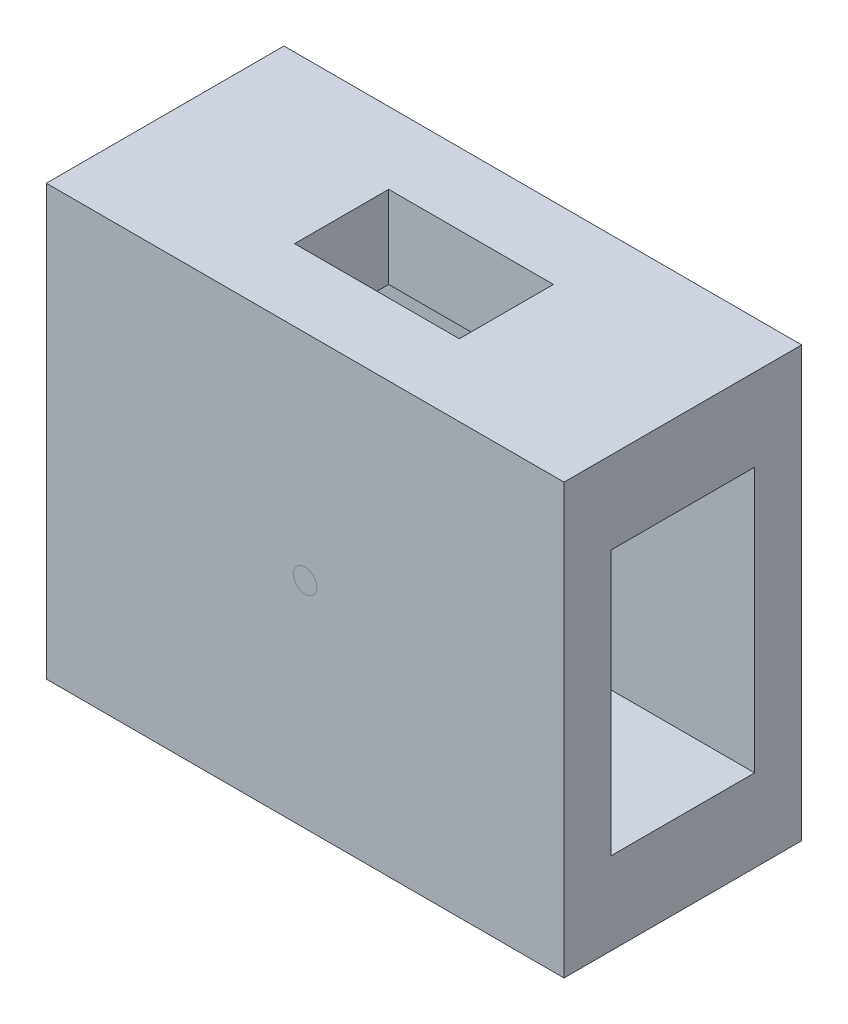
ISO-10303-21;
HEADER;
FILE_DESCRIPTION(('STEP AP214'),'2;1');
FILE_NAME('part.step','',(''),(''),'','','');
FILE_SCHEMA(('AUTOMOTIVE_DESIGN { 1 0 10303 214 1 1 1 1 }'));
ENDSEC;
DATA;
#1=APPLICATION_CONTEXT('core data for automotive mechanical design processes');
#2=APPLICATION_PROTOCOL_DEFINITION('international standard','automotive_design',2000,#1);
#3=PRODUCT_CONTEXT('',#1,'mechanical');
#4=PRODUCT('Part','Part','',(#3));
#5=PRODUCT_RELATED_PRODUCT_CATEGORY('part','',(#4));
#6=PRODUCT_DEFINITION_FORMATION('','',#4);
#7=PRODUCT_DEFINITION_CONTEXT('part definition',#1,'design');
#8=PRODUCT_DEFINITION('design','',#6,#7);
#9=PRODUCT_DEFINITION_SHAPE('','',#8);
#10=(LENGTH_UNIT() NAMED_UNIT(*) SI_UNIT(.MILLI.,.METRE.));
#11=(NAMED_UNIT(*) PLANE_ANGLE_UNIT() SI_UNIT($,.RADIAN.));
#12=(NAMED_UNIT(*) SI_UNIT($,.STERADIAN.) SOLID_ANGLE_UNIT());
#13=UNCERTAINTY_MEASURE_WITH_UNIT(LENGTH_MEASURE(1.E-05),#10,'distance_accuracy_value','');
#14=(GEOMETRIC_REPRESENTATION_CONTEXT(3) GLOBAL_UNCERTAINTY_ASSIGNED_CONTEXT((#13)) GLOBAL_UNIT_ASSIGNED_CONTEXT((#10,
#11,#12)) REPRESENTATION_CONTEXT('',''));
#15=CARTESIAN_POINT('',(0.,0.,0.));
#16=DIRECTION('',(0.,0.,1.));
#17=DIRECTION('',(1.,0.,0.));
#18=AXIS2_PLACEMENT_3D('',#15,#16,#17);
#19=CARTESIAN_POINT('',(22.,0.,0.));
#20=DIRECTION('',(-1.,0.,0.));
#21=DIRECTION('',(0.,0.,1.));
#22=AXIS2_PLACEMENT_3D('',#19,#20,#21);
#23=PLANE('',#22);
#24=DIRECTION('',(0.,1.,0.));
#25=VECTOR('',#24,1.);
#26=CARTESIAN_POINT('',(22.,-18.25,-10.1));
#27=LINE('',#26,#25);
#28=CARTESIAN_POINT('',(22.,-18.25,-10.1));
#29=VERTEX_POINT('',#28);
#30=CARTESIAN_POINT('',(22.,18.25,-10.1));
#31=VERTEX_POINT('',#30);
#32=EDGE_CURVE('E215',#29,#31,#27,.T.);
#33=ORIENTED_EDGE('',*,*,#32,.T.);
#34=DIRECTION('',(0.,0.,1.));
#35=VECTOR('',#34,1.);
#36=CARTESIAN_POINT('',(22.,18.25,10.1));
#37=LINE('',#36,#35);
#38=CARTESIAN_POINT('',(22.,18.25,10.1));
#39=VERTEX_POINT('',#38);
#40=EDGE_CURVE('E218',#31,#39,#37,.T.);
#41=ORIENTED_EDGE('',*,*,#40,.T.);
#42=DIRECTION('',(0.,-1.,0.));
#43=VECTOR('',#42,1.);
#44=CARTESIAN_POINT('',(22.,-18.25,10.1));
#45=LINE('',#44,#43);
#46=CARTESIAN_POINT('',(22.,-18.25,10.1));
#47=VERTEX_POINT('',#46);
#48=EDGE_CURVE('E221',#39,#47,#45,.T.);
#49=ORIENTED_EDGE('',*,*,#48,.T.);
#50=DIRECTION('',(0.,0.,-1.));
#51=VECTOR('',#50,1.);
#52=CARTESIAN_POINT('',(22.,-18.25,10.1));
#53=LINE('',#52,#51);
#54=EDGE_CURVE('E223',#47,#29,#53,.T.);
#55=ORIENTED_EDGE('',*,*,#54,.T.);
#56=EDGE_LOOP('',(#33,#41,#49,#55));
#57=FACE_BOUND('',#56,.T.);
#58=DIRECTION('',(0.,1.,0.));
#59=VECTOR('',#58,1.);
#60=CARTESIAN_POINT('',(22.,-11.25,-6.1));
#61=LINE('',#60,#59);
#62=CARTESIAN_POINT('',(22.,-11.25,-6.1));
#63=VERTEX_POINT('',#62);
#64=CARTESIAN_POINT('',(22.,11.25,-6.1));
#65=VERTEX_POINT('',#64);
#66=EDGE_CURVE('E184',#63,#65,#61,.T.);
#67=ORIENTED_EDGE('',*,*,#66,.F.);
#68=DIRECTION('',(0.,0.,-1.));
#69=VECTOR('',#68,1.);
#70=CARTESIAN_POINT('',(22.,-11.25,6.1));
#71=LINE('',#70,#69);
#72=CARTESIAN_POINT('',(22.,-11.25,6.1));
#73=VERTEX_POINT('',#72);
#74=EDGE_CURVE('E192',#73,#63,#71,.T.);
#75=ORIENTED_EDGE('',*,*,#74,.F.);
#76=DIRECTION('',(0.,-1.,0.));
#77=VECTOR('',#76,1.);
#78=CARTESIAN_POINT('',(22.,-11.25,6.1));
#79=LINE('',#78,#77);
#80=CARTESIAN_POINT('',(22.,11.25,6.1));
#81=VERTEX_POINT('',#80);
#82=EDGE_CURVE('E189',#81,#73,#79,.T.);
#83=ORIENTED_EDGE('',*,*,#82,.F.);
#84=DIRECTION('',(0.,0.,1.));
#85=VECTOR('',#84,1.);
#86=CARTESIAN_POINT('',(22.,11.25,6.1));
#87=LINE('',#86,#85);
#88=EDGE_CURVE('E186',#65,#81,#87,.T.);
#89=ORIENTED_EDGE('',*,*,#88,.F.);
#90=EDGE_LOOP('',(#67,#75,#83,#89));
#91=FACE_BOUND('',#90,.T.);
#92=ADVANCED_FACE('F34',(#57,#91),#23,.F.);
#93=CARTESIAN_POINT('',(-22.,0.,0.));
#94=DIRECTION('',(-1.,0.,0.));
#95=DIRECTION('',(0.,0.,1.));
#96=AXIS2_PLACEMENT_3D('',#93,#94,#95);
#97=PLANE('',#96);
#98=DIRECTION('',(0.,1.,0.));
#99=VECTOR('',#98,1.);
#100=CARTESIAN_POINT('',(-22.,-18.25,-10.1));
#101=LINE('',#100,#99);
#102=CARTESIAN_POINT('',(-22.,-18.25,-10.1));
#103=VERTEX_POINT('',#102);
#104=CARTESIAN_POINT('',(-22.,18.25,-10.1));
#105=VERTEX_POINT('',#104);
#106=EDGE_CURVE('E214',#103,#105,#101,.T.);
#107=ORIENTED_EDGE('',*,*,#106,.F.);
#108=DIRECTION('',(0.,0.,-1.));
#109=VECTOR('',#108,1.);
#110=CARTESIAN_POINT('',(-22.,-18.25,10.1));
#111=LINE('',#110,#109);
#112=CARTESIAN_POINT('',(-22.,-18.25,10.1));
#113=VERTEX_POINT('',#112);
#114=EDGE_CURVE('E219',#113,#103,#111,.T.);
#115=ORIENTED_EDGE('',*,*,#114,.F.);
#116=DIRECTION('',(0.,-1.,0.));
#117=VECTOR('',#116,1.);
#118=CARTESIAN_POINT('',(-22.,-18.25,10.1));
#119=LINE('',#118,#117);
#120=CARTESIAN_POINT('',(-22.,18.25,10.1));
#121=VERTEX_POINT('',#120);
#122=EDGE_CURVE('E230',#121,#113,#119,.T.);
#123=ORIENTED_EDGE('',*,*,#122,.F.);
#124=DIRECTION('',(0.,0.,1.));
#125=VECTOR('',#124,1.);
#126=CARTESIAN_POINT('',(-22.,18.25,10.1));
#127=LINE('',#126,#125);
#128=EDGE_CURVE('E228',#105,#121,#127,.T.);
#129=ORIENTED_EDGE('',*,*,#128,.F.);
#130=EDGE_LOOP('',(#107,#115,#123,#129));
#131=FACE_BOUND('',#130,.T.);
#132=DIRECTION('',(0.,0.,-1.));
#133=VECTOR('',#132,1.);
#134=CARTESIAN_POINT('',(-22.,-11.25,6.1));
#135=LINE('',#134,#133);
#136=CARTESIAN_POINT('',(-22.,-11.25,6.1));
#137=VERTEX_POINT('',#136);
#138=CARTESIAN_POINT('',(-22.,-11.25,-6.1));
#139=VERTEX_POINT('',#138);
#140=EDGE_CURVE('E187',#137,#139,#135,.T.);
#141=ORIENTED_EDGE('',*,*,#140,.T.);
#142=DIRECTION('',(0.,1.,0.));
#143=VECTOR('',#142,1.);
#144=CARTESIAN_POINT('',(-22.,-11.25,-6.1));
#145=LINE('',#144,#143);
#146=CARTESIAN_POINT('',(-22.,11.25,-6.1));
#147=VERTEX_POINT('',#146);
#148=EDGE_CURVE('E181',#139,#147,#145,.T.);
#149=ORIENTED_EDGE('',*,*,#148,.T.);
#150=DIRECTION('',(0.,0.,1.));
#151=VECTOR('',#150,1.);
#152=CARTESIAN_POINT('',(-22.,11.25,6.1));
#153=LINE('',#152,#151);
#154=CARTESIAN_POINT('',(-22.,11.25,6.1));
#155=VERTEX_POINT('',#154);
#156=EDGE_CURVE('E197',#147,#155,#153,.T.);
#157=ORIENTED_EDGE('',*,*,#156,.T.);
#158=DIRECTION('',(0.,-1.,0.));
#159=VECTOR('',#158,1.);
#160=CARTESIAN_POINT('',(-22.,-11.25,6.1));
#161=LINE('',#160,#159);
#162=EDGE_CURVE('E200',#155,#137,#161,.T.);
#163=ORIENTED_EDGE('',*,*,#162,.T.);
#164=EDGE_LOOP('',(#141,#149,#157,#163));
#165=FACE_BOUND('',#164,.T.);
#166=ADVANCED_FACE('F312',(#131,#165),#97,.T.);
#167=CARTESIAN_POINT('',(22.,-18.25,-10.1));
#168=DIRECTION('',(0.,0.,1.));
#169=DIRECTION('',(1.,0.,0.));
#170=AXIS2_PLACEMENT_3D('',#167,#168,#169);
#171=PLANE('',#170);
#172=ORIENTED_EDGE('',*,*,#106,.T.);
#173=DIRECTION('',(-1.,0.,0.));
#174=VECTOR('',#173,1.);
#175=CARTESIAN_POINT('',(22.,18.25,-10.1));
#176=LINE('',#175,#174);
#177=EDGE_CURVE('E241',#31,#105,#176,.T.);
#178=ORIENTED_EDGE('',*,*,#177,.F.);
#179=ORIENTED_EDGE('',*,*,#32,.F.);
#180=DIRECTION('',(-1.,0.,0.));
#181=VECTOR('',#180,1.);
#182=CARTESIAN_POINT('',(22.,-18.25,-10.1));
#183=LINE('',#182,#181);
#184=EDGE_CURVE('E225',#29,#103,#183,.T.);
#185=ORIENTED_EDGE('',*,*,#184,.T.);
#186=EDGE_LOOP('',(#172,#178,#179,#185));
#187=FACE_BOUND('',#186,.T.);
#188=ADVANCED_FACE('F36',(#187),#171,.F.);
#189=CARTESIAN_POINT('',(22.,18.25,10.1));
#190=DIRECTION('',(0.,-1.,0.));
#191=DIRECTION('',(0.,0.,-1.));
#192=AXIS2_PLACEMENT_3D('',#189,#190,#191);
#193=PLANE('',#192);
#194=DIRECTION('',(1.,0.,0.));
#195=VECTOR('',#194,1.);
#196=CARTESIAN_POINT('',(22.,18.25,-4.));
#197=LINE('',#196,#195);
#198=CARTESIAN_POINT('',(-7.,18.25,-4.));
#199=VERTEX_POINT('',#198);
#200=CARTESIAN_POINT('',(7.,18.25,-4.));
#201=VERTEX_POINT('',#200);
#202=EDGE_CURVE('E152',#199,#201,#197,.T.);
#203=ORIENTED_EDGE('',*,*,#202,.T.);
#204=DIRECTION('',(0.,0.,1.));
#205=VECTOR('',#204,1.);
#206=CARTESIAN_POINT('',(7.,18.25,10.1));
#207=LINE('',#206,#205);
#208=CARTESIAN_POINT('',(7.,18.25,4.));
#209=VERTEX_POINT('',#208);
#210=EDGE_CURVE('E168',#201,#209,#207,.T.);
#211=ORIENTED_EDGE('',*,*,#210,.T.);
#212=DIRECTION('',(-1.,0.,0.));
#213=VECTOR('',#212,1.);
#214=CARTESIAN_POINT('',(22.,18.25,4.));
#215=LINE('',#214,#213);
#216=CARTESIAN_POINT('',(-7.,18.25,4.));
#217=VERTEX_POINT('',#216);
#218=EDGE_CURVE('E174',#209,#217,#215,.T.);
#219=ORIENTED_EDGE('',*,*,#218,.T.);
#220=DIRECTION('',(0.,0.,-1.));
#221=VECTOR('',#220,1.);
#222=CARTESIAN_POINT('',(-7.,18.25,10.1));
#223=LINE('',#222,#221);
#224=EDGE_CURVE('E276',#217,#199,#223,.T.);
#225=ORIENTED_EDGE('',*,*,#224,.T.);
#226=EDGE_LOOP('',(#203,#211,#219,#225));
#227=FACE_BOUND('',#226,.T.);
#228=ORIENTED_EDGE('',*,*,#128,.T.);
#229=DIRECTION('',(-1.,0.,0.));
#230=VECTOR('',#229,1.);
#231=CARTESIAN_POINT('',(22.,18.25,10.1));
#232=LINE('',#231,#230);
#233=EDGE_CURVE('E238',#39,#121,#232,.T.);
#234=ORIENTED_EDGE('',*,*,#233,.F.);
#235=ORIENTED_EDGE('',*,*,#40,.F.);
#236=ORIENTED_EDGE('',*,*,#177,.T.);
#237=EDGE_LOOP('',(#228,#234,#235,#236));
#238=FACE_BOUND('',#237,.T.);
#239=ADVANCED_FACE('F283',(#227,#238),#193,.F.);
#240=CARTESIAN_POINT('',(22.,-18.25,10.1));
#241=DIRECTION('',(0.,0.,-1.));
#242=DIRECTION('',(-1.,0.,0.));
#243=AXIS2_PLACEMENT_3D('',#240,#241,#242);
#244=PLANE('',#243);
#245=CARTESIAN_POINT('',(0.,0.,10.1));
#246=DIRECTION('',(0.,0.,1.));
#247=DIRECTION('',(1.,0.,0.));
#248=AXIS2_PLACEMENT_3D('',#245,#246,#247);
#249=CIRCLE('',#248,1.);
#250=CARTESIAN_POINT('',(1.,0.,10.1));
#251=VERTEX_POINT('',#250);
#252=EDGE_CURVE('E172',#251,#251,#249,.T.);
#253=ORIENTED_EDGE('',*,*,#252,.F.);
#254=EDGE_LOOP('',(#253));
#255=FACE_BOUND('',#254,.T.);
#256=ORIENTED_EDGE('',*,*,#122,.T.);
#257=DIRECTION('',(-1.,0.,0.));
#258=VECTOR('',#257,1.);
#259=CARTESIAN_POINT('',(22.,-18.25,10.1));
#260=LINE('',#259,#258);
#261=EDGE_CURVE('E235',#47,#113,#260,.T.);
#262=ORIENTED_EDGE('',*,*,#261,.F.);
#263=ORIENTED_EDGE('',*,*,#48,.F.);
#264=ORIENTED_EDGE('',*,*,#233,.T.);
#265=EDGE_LOOP('',(#256,#262,#263,#264));
#266=FACE_BOUND('',#265,.T.);
#267=ADVANCED_FACE('F327',(#255,#266),#244,.F.);
#268=CARTESIAN_POINT('',(22.,-18.25,10.1));
#269=DIRECTION('',(0.,1.,0.));
#270=DIRECTION('',(0.,0.,1.));
#271=AXIS2_PLACEMENT_3D('',#268,#269,#270);
#272=PLANE('',#271);
#273=DIRECTION('',(1.,0.,0.));
#274=VECTOR('',#273,1.);
#275=CARTESIAN_POINT('',(22.,-18.25,4.));
#276=LINE('',#275,#274);
#277=CARTESIAN_POINT('',(-7.,-18.25,4.));
#278=VERTEX_POINT('',#277);
#279=CARTESIAN_POINT('',(7.,-18.25,4.));
#280=VERTEX_POINT('',#279);
#281=EDGE_CURVE('E167',#278,#280,#276,.T.);
#282=ORIENTED_EDGE('',*,*,#281,.T.);
#283=DIRECTION('',(0.,0.,-1.));
#284=VECTOR('',#283,1.);
#285=CARTESIAN_POINT('',(7.,-18.25,10.1));
#286=LINE('',#285,#284);
#287=CARTESIAN_POINT('',(7.,-18.25,-4.));
#288=VERTEX_POINT('',#287);
#289=EDGE_CURVE('E158',#280,#288,#286,.T.);
#290=ORIENTED_EDGE('',*,*,#289,.T.);
#291=DIRECTION('',(-1.,0.,0.));
#292=VECTOR('',#291,1.);
#293=CARTESIAN_POINT('',(22.,-18.25,-4.));
#294=LINE('',#293,#292);
#295=CARTESIAN_POINT('',(-7.,-18.25,-4.));
#296=VERTEX_POINT('',#295);
#297=EDGE_CURVE('E145',#288,#296,#294,.T.);
#298=ORIENTED_EDGE('',*,*,#297,.T.);
#299=DIRECTION('',(0.,0.,1.));
#300=VECTOR('',#299,1.);
#301=CARTESIAN_POINT('',(-7.,-18.25,10.1));
#302=LINE('',#301,#300);
#303=EDGE_CURVE('E262',#296,#278,#302,.T.);
#304=ORIENTED_EDGE('',*,*,#303,.T.);
#305=EDGE_LOOP('',(#282,#290,#298,#304));
#306=FACE_BOUND('',#305,.T.);
#307=ORIENTED_EDGE('',*,*,#114,.T.);
#308=ORIENTED_EDGE('',*,*,#184,.F.);
#309=ORIENTED_EDGE('',*,*,#54,.F.);
#310=ORIENTED_EDGE('',*,*,#261,.T.);
#311=EDGE_LOOP('',(#307,#308,#309,#310));
#312=FACE_BOUND('',#311,.T.);
#313=ADVANCED_FACE('F165',(#306,#312),#272,.F.);
#314=CARTESIAN_POINT('',(22.,-11.25,-6.1));
#315=DIRECTION('',(0.,0.,1.));
#316=DIRECTION('',(1.,0.,0.));
#317=AXIS2_PLACEMENT_3D('',#314,#315,#316);
#318=PLANE('',#317);
#319=ORIENTED_EDGE('',*,*,#148,.F.);
#320=DIRECTION('',(-1.,0.,0.));
#321=VECTOR('',#320,1.);
#322=CARTESIAN_POINT('',(22.,-11.25,-6.1));
#323=LINE('',#322,#321);
#324=EDGE_CURVE('E194',#63,#139,#323,.T.);
#325=ORIENTED_EDGE('',*,*,#324,.F.);
#326=ORIENTED_EDGE('',*,*,#66,.T.);
#327=DIRECTION('',(-1.,0.,0.));
#328=VECTOR('',#327,1.);
#329=CARTESIAN_POINT('',(22.,11.25,-6.1));
#330=LINE('',#329,#328);
#331=EDGE_CURVE('E211',#65,#147,#330,.T.);
#332=ORIENTED_EDGE('',*,*,#331,.T.);
#333=EDGE_LOOP('',(#319,#325,#326,#332));
#334=FACE_BOUND('',#333,.T.);
#335=ADVANCED_FACE('F322',(#334),#318,.T.);
#336=CARTESIAN_POINT('',(22.,11.25,6.1));
#337=DIRECTION('',(0.,-1.,0.));
#338=DIRECTION('',(0.,0.,-1.));
#339=AXIS2_PLACEMENT_3D('',#336,#337,#338);
#340=PLANE('',#339);
#341=DIRECTION('',(0.,0.,1.));
#342=VECTOR('',#341,1.);
#343=CARTESIAN_POINT('',(7.,11.25,6.1));
#344=LINE('',#343,#342);
#345=CARTESIAN_POINT('',(7.,11.25,-4.));
#346=VERTEX_POINT('',#345);
#347=CARTESIAN_POINT('',(7.,11.25,4.));
#348=VERTEX_POINT('',#347);
#349=EDGE_CURVE('E169',#346,#348,#344,.T.);
#350=ORIENTED_EDGE('',*,*,#349,.F.);
#351=DIRECTION('',(1.,0.,0.));
#352=VECTOR('',#351,1.);
#353=CARTESIAN_POINT('',(22.,11.25,-4.));
#354=LINE('',#353,#352);
#355=CARTESIAN_POINT('',(-7.,11.25,-4.));
#356=VERTEX_POINT('',#355);
#357=EDGE_CURVE('E153',#356,#346,#354,.T.);
#358=ORIENTED_EDGE('',*,*,#357,.F.);
#359=DIRECTION('',(0.,0.,-1.));
#360=VECTOR('',#359,1.);
#361=CARTESIAN_POINT('',(-7.,11.25,6.1));
#362=LINE('',#361,#360);
#363=CARTESIAN_POINT('',(-7.,11.25,4.));
#364=VERTEX_POINT('',#363);
#365=EDGE_CURVE('E272',#364,#356,#362,.T.);
#366=ORIENTED_EDGE('',*,*,#365,.F.);
#367=DIRECTION('',(-1.,0.,0.));
#368=VECTOR('',#367,1.);
#369=CARTESIAN_POINT('',(22.,11.25,4.));
#370=LINE('',#369,#368);
#371=EDGE_CURVE('E279',#348,#364,#370,.T.);
#372=ORIENTED_EDGE('',*,*,#371,.F.);
#373=EDGE_LOOP('',(#350,#358,#366,#372));
#374=FACE_BOUND('',#373,.T.);
#375=ORIENTED_EDGE('',*,*,#156,.F.);
#376=ORIENTED_EDGE('',*,*,#331,.F.);
#377=ORIENTED_EDGE('',*,*,#88,.T.);
#378=DIRECTION('',(-1.,0.,0.));
#379=VECTOR('',#378,1.);
#380=CARTESIAN_POINT('',(22.,11.25,6.1));
#381=LINE('',#380,#379);
#382=EDGE_CURVE('E209',#81,#155,#381,.T.);
#383=ORIENTED_EDGE('',*,*,#382,.T.);
#384=EDGE_LOOP('',(#375,#376,#377,#383));
#385=FACE_BOUND('',#384,.T.);
#386=ADVANCED_FACE('F296',(#374,#385),#340,.T.);
#387=CARTESIAN_POINT('',(22.,-11.25,6.1));
#388=DIRECTION('',(0.,0.,-1.));
#389=DIRECTION('',(-1.,0.,0.));
#390=AXIS2_PLACEMENT_3D('',#387,#388,#389);
#391=PLANE('',#390);
#392=ORIENTED_EDGE('',*,*,#162,.F.);
#393=ORIENTED_EDGE('',*,*,#382,.F.);
#394=ORIENTED_EDGE('',*,*,#82,.T.);
#395=DIRECTION('',(-1.,0.,0.));
#396=VECTOR('',#395,1.);
#397=CARTESIAN_POINT('',(22.,-11.25,6.1));
#398=LINE('',#397,#396);
#399=EDGE_CURVE('E207',#73,#137,#398,.T.);
#400=ORIENTED_EDGE('',*,*,#399,.T.);
#401=EDGE_LOOP('',(#392,#393,#394,#400));
#402=FACE_BOUND('',#401,.T.);
#403=ADVANCED_FACE('F360',(#402),#391,.T.);
#404=CARTESIAN_POINT('',(22.,-11.25,6.1));
#405=DIRECTION('',(0.,1.,0.));
#406=DIRECTION('',(0.,0.,1.));
#407=AXIS2_PLACEMENT_3D('',#404,#405,#406);
#408=PLANE('',#407);
#409=DIRECTION('',(0.,0.,-1.));
#410=VECTOR('',#409,1.);
#411=CARTESIAN_POINT('',(7.,-11.25,6.1));
#412=LINE('',#411,#410);
#413=CARTESIAN_POINT('',(7.,-11.25,4.));
#414=VERTEX_POINT('',#413);
#415=CARTESIAN_POINT('',(7.,-11.25,-4.));
#416=VERTEX_POINT('',#415);
#417=EDGE_CURVE('E11',#414,#416,#412,.T.);
#418=ORIENTED_EDGE('',*,*,#417,.F.);
#419=DIRECTION('',(1.,0.,0.));
#420=VECTOR('',#419,1.);
#421=CARTESIAN_POINT('',(22.,-11.25,4.));
#422=LINE('',#421,#420);
#423=CARTESIAN_POINT('',(-7.,-11.25,4.));
#424=VERTEX_POINT('',#423);
#425=EDGE_CURVE('E42',#424,#414,#422,.T.);
#426=ORIENTED_EDGE('',*,*,#425,.F.);
#427=DIRECTION('',(0.,0.,1.));
#428=VECTOR('',#427,1.);
#429=CARTESIAN_POINT('',(-7.,-11.25,6.1));
#430=LINE('',#429,#428);
#431=CARTESIAN_POINT('',(-7.,-11.25,-4.));
#432=VERTEX_POINT('',#431);
#433=EDGE_CURVE('E246',#432,#424,#430,.T.);
#434=ORIENTED_EDGE('',*,*,#433,.F.);
#435=DIRECTION('',(-1.,0.,0.));
#436=VECTOR('',#435,1.);
#437=CARTESIAN_POINT('',(22.,-11.25,-4.));
#438=LINE('',#437,#436);
#439=EDGE_CURVE('E244',#416,#432,#438,.T.);
#440=ORIENTED_EDGE('',*,*,#439,.F.);
#441=EDGE_LOOP('',(#418,#426,#434,#440));
#442=FACE_BOUND('',#441,.T.);
#443=ORIENTED_EDGE('',*,*,#140,.F.);
#444=ORIENTED_EDGE('',*,*,#399,.F.);
#445=ORIENTED_EDGE('',*,*,#74,.T.);
#446=ORIENTED_EDGE('',*,*,#324,.T.);
#447=EDGE_LOOP('',(#443,#444,#445,#446));
#448=FACE_BOUND('',#447,.T.);
#449=ADVANCED_FACE('F258',(#442,#448),#408,.T.);
#450=CARTESIAN_POINT('',(0.,0.,10.0999));
#451=DIRECTION('',(0.,0.,1.));
#452=DIRECTION('',(1.,0.,0.));
#453=AXIS2_PLACEMENT_3D('',#450,#451,#452);
#454=CYLINDRICAL_SURFACE('',#453,1.);
#455=CARTESIAN_POINT('',(0.,0.,10.0999));
#456=DIRECTION('',(0.,0.,1.));
#457=DIRECTION('',(1.,0.,0.));
#458=AXIS2_PLACEMENT_3D('',#455,#456,#457);
#459=CIRCLE('',#458,1.);
#460=CARTESIAN_POINT('',(1.,0.,10.0999));
#461=VERTEX_POINT('',#460);
#462=EDGE_CURVE('E178',#461,#461,#459,.T.);
#463=ORIENTED_EDGE('',*,*,#462,.F.);
#464=EDGE_LOOP('',(#463));
#465=FACE_BOUND('',#464,.T.);
#466=ORIENTED_EDGE('',*,*,#252,.T.);
#467=EDGE_LOOP('',(#466));
#468=FACE_BOUND('',#467,.T.);
#469=ADVANCED_FACE('F367',(#465,#468),#454,.F.);
#470=CARTESIAN_POINT('',(0.,0.,10.0999));
#471=DIRECTION('',(0.,0.,1.));
#472=DIRECTION('',(1.,0.,0.));
#473=AXIS2_PLACEMENT_3D('',#470,#471,#472);
#474=PLANE('',#473);
#475=ORIENTED_EDGE('',*,*,#462,.T.);
#476=EDGE_LOOP('',(#475));
#477=FACE_BOUND('',#476,.T.);
#478=ADVANCED_FACE('F310',(#477),#474,.T.);
#479=CARTESIAN_POINT('',(-7.,-25.,-4.));
#480=DIRECTION('',(0.,0.,-1.));
#481=DIRECTION('',(-1.,0.,0.));
#482=AXIS2_PLACEMENT_3D('',#479,#480,#481);
#483=PLANE('',#482);
#484=DIRECTION('',(0.,1.,0.));
#485=VECTOR('',#484,1.);
#486=CARTESIAN_POINT('',(7.,-25.,-4.));
#487=LINE('',#486,#485);
#488=EDGE_CURVE('E148',#288,#416,#487,.T.);
#489=ORIENTED_EDGE('',*,*,#488,.T.);
#490=ORIENTED_EDGE('',*,*,#439,.T.);
#491=DIRECTION('',(0.,1.,0.));
#492=VECTOR('',#491,1.);
#493=CARTESIAN_POINT('',(-7.,-25.,-4.));
#494=LINE('',#493,#492);
#495=EDGE_CURVE('E57',#296,#432,#494,.T.);
#496=ORIENTED_EDGE('',*,*,#495,.F.);
#497=ORIENTED_EDGE('',*,*,#297,.F.);
#498=EDGE_LOOP('',(#489,#490,#496,#497));
#499=FACE_BOUND('',#498,.T.);
#500=ADVANCED_FACE('F147',(#499),#483,.F.);
#501=CARTESIAN_POINT('',(-7.,-25.,4.));
#502=DIRECTION('',(-1.,0.,0.));
#503=DIRECTION('',(0.,0.,1.));
#504=AXIS2_PLACEMENT_3D('',#501,#502,#503);
#505=PLANE('',#504);
#506=ORIENTED_EDGE('',*,*,#495,.T.);
#507=ORIENTED_EDGE('',*,*,#433,.T.);
#508=DIRECTION('',(0.,1.,0.));
#509=VECTOR('',#508,1.);
#510=CARTESIAN_POINT('',(-7.,-25.,4.));
#511=LINE('',#510,#509);
#512=EDGE_CURVE('E253',#278,#424,#511,.T.);
#513=ORIENTED_EDGE('',*,*,#512,.F.);
#514=ORIENTED_EDGE('',*,*,#303,.F.);
#515=EDGE_LOOP('',(#506,#507,#513,#514));
#516=FACE_BOUND('',#515,.T.);
#517=ADVANCED_FACE('F261',(#516),#505,.F.);
#518=CARTESIAN_POINT('',(-7.,-25.,4.));
#519=DIRECTION('',(0.,0.,1.));
#520=DIRECTION('',(1.,0.,0.));
#521=AXIS2_PLACEMENT_3D('',#518,#519,#520);
#522=PLANE('',#521);
#523=ORIENTED_EDGE('',*,*,#512,.T.);
#524=ORIENTED_EDGE('',*,*,#425,.T.);
#525=DIRECTION('',(0.,1.,0.));
#526=VECTOR('',#525,1.);
#527=CARTESIAN_POINT('',(7.,-25.,4.));
#528=LINE('',#527,#526);
#529=EDGE_CURVE('E251',#280,#414,#528,.T.);
#530=ORIENTED_EDGE('',*,*,#529,.F.);
#531=ORIENTED_EDGE('',*,*,#281,.F.);
#532=EDGE_LOOP('',(#523,#524,#530,#531));
#533=FACE_BOUND('',#532,.T.);
#534=ADVANCED_FACE('F250',(#533),#522,.F.);
#535=CARTESIAN_POINT('',(7.,-25.,4.));
#536=DIRECTION('',(1.,0.,0.));
#537=DIRECTION('',(0.,0.,-1.));
#538=AXIS2_PLACEMENT_3D('',#535,#536,#537);
#539=PLANE('',#538);
#540=ORIENTED_EDGE('',*,*,#529,.T.);
#541=ORIENTED_EDGE('',*,*,#417,.T.);
#542=ORIENTED_EDGE('',*,*,#488,.F.);
#543=ORIENTED_EDGE('',*,*,#289,.F.);
#544=EDGE_LOOP('',(#540,#541,#542,#543));
#545=FACE_BOUND('',#544,.T.);
#546=ADVANCED_FACE('F157',(#545),#539,.F.);
#547=EDGE_CURVE('E49',#346,#201,#487,.T.);
#548=ORIENTED_EDGE('',*,*,#547,.F.);
#549=ORIENTED_EDGE('',*,*,#349,.T.);
#550=EDGE_CURVE('E256',#348,#209,#528,.T.);
#551=ORIENTED_EDGE('',*,*,#550,.T.);
#552=ORIENTED_EDGE('',*,*,#210,.F.);
#553=EDGE_LOOP('',(#548,#549,#551,#552));
#554=FACE_BOUND('',#553,.T.);
#555=ADVANCED_FACE('F292',(#554),#539,.F.);
#556=ORIENTED_EDGE('',*,*,#550,.F.);
#557=ORIENTED_EDGE('',*,*,#371,.T.);
#558=EDGE_CURVE('E263',#364,#217,#511,.T.);
#559=ORIENTED_EDGE('',*,*,#558,.T.);
#560=ORIENTED_EDGE('',*,*,#218,.F.);
#561=EDGE_LOOP('',(#556,#557,#559,#560));
#562=FACE_BOUND('',#561,.T.);
#563=ADVANCED_FACE('F288',(#562),#522,.F.);
#564=ORIENTED_EDGE('',*,*,#558,.F.);
#565=ORIENTED_EDGE('',*,*,#365,.T.);
#566=EDGE_CURVE('E162',#356,#199,#494,.T.);
#567=ORIENTED_EDGE('',*,*,#566,.T.);
#568=ORIENTED_EDGE('',*,*,#224,.F.);
#569=EDGE_LOOP('',(#564,#565,#567,#568));
#570=FACE_BOUND('',#569,.T.);
#571=ADVANCED_FACE('F300',(#570),#505,.F.);
#572=ORIENTED_EDGE('',*,*,#566,.F.);
#573=ORIENTED_EDGE('',*,*,#357,.T.);
#574=ORIENTED_EDGE('',*,*,#547,.T.);
#575=ORIENTED_EDGE('',*,*,#202,.F.);
#576=EDGE_LOOP('',(#572,#573,#574,#575));
#577=FACE_BOUND('',#576,.T.);
#578=ADVANCED_FACE('F301',(#577),#483,.F.);
#579=CLOSED_SHELL('',(#92,#166,#188,#239,#267,#313,#335,#386,#403,#449,#469,#478,#500,#517,#534,
#546,#555,#563,#571,#578));
#580=MANIFOLD_SOLID_BREP('B2',#579);
#581=ADVANCED_BREP_SHAPE_REPRESENTATION('',(#18,#580),#14);
#582=SHAPE_DEFINITION_REPRESENTATION(#9,#581);
ENDSEC;
END-ISO-10303-21;
